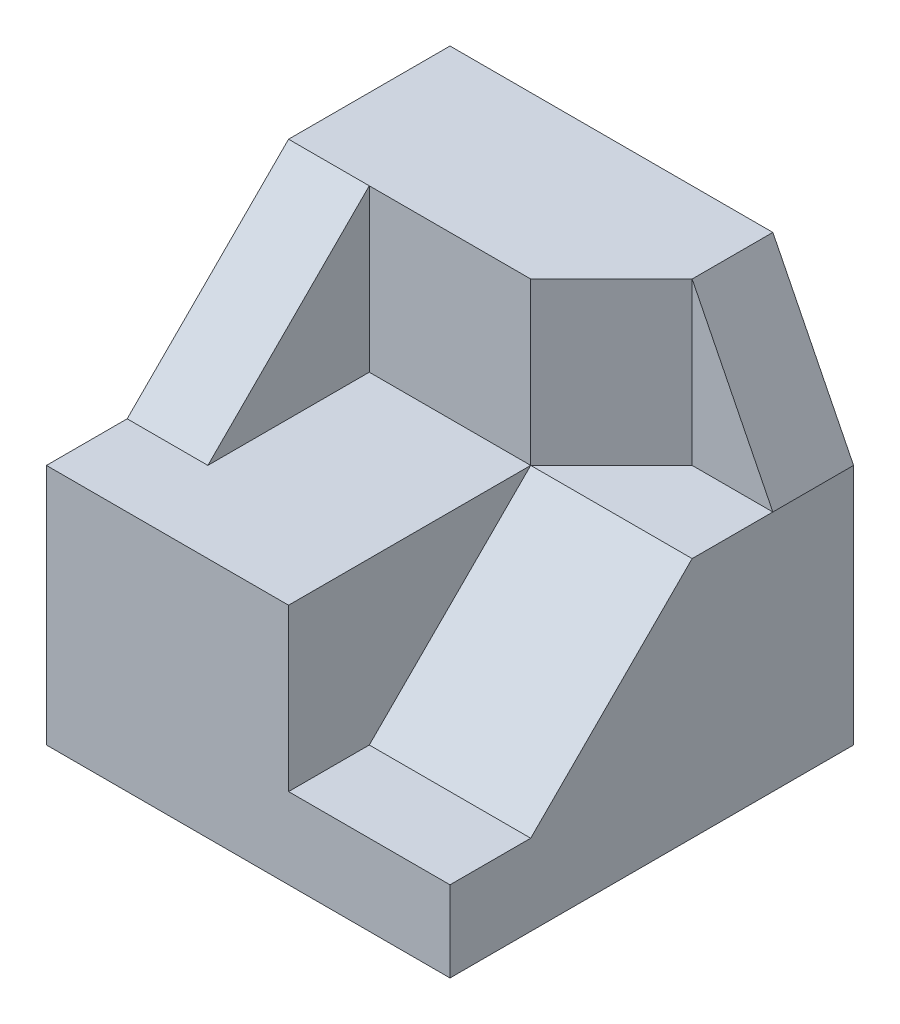
ISO-10303-21;
HEADER;
FILE_DESCRIPTION(('STEP AP214'),'2;1');
FILE_NAME('part.step','',(''),(''),'','','');
FILE_SCHEMA(('AUTOMOTIVE_DESIGN { 1 0 10303 214 1 1 1 1 }'));
ENDSEC;
DATA;
#1=APPLICATION_CONTEXT('core data for automotive mechanical design processes');
#2=APPLICATION_PROTOCOL_DEFINITION('international standard','automotive_design',2000,#1);
#3=PRODUCT_CONTEXT('',#1,'mechanical');
#4=PRODUCT('Part','Part','',(#3));
#5=PRODUCT_RELATED_PRODUCT_CATEGORY('part','',(#4));
#6=PRODUCT_DEFINITION_FORMATION('','',#4);
#7=PRODUCT_DEFINITION_CONTEXT('part definition',#1,'design');
#8=PRODUCT_DEFINITION('design','',#6,#7);
#9=PRODUCT_DEFINITION_SHAPE('','',#8);
#10=(LENGTH_UNIT() NAMED_UNIT(*) SI_UNIT(.MILLI.,.METRE.));
#11=(NAMED_UNIT(*) PLANE_ANGLE_UNIT() SI_UNIT($,.RADIAN.));
#12=(NAMED_UNIT(*) SI_UNIT($,.STERADIAN.) SOLID_ANGLE_UNIT());
#13=UNCERTAINTY_MEASURE_WITH_UNIT(LENGTH_MEASURE(1.E-05),#10,'distance_accuracy_value','');
#14=(GEOMETRIC_REPRESENTATION_CONTEXT(3) GLOBAL_UNCERTAINTY_ASSIGNED_CONTEXT((#13)) GLOBAL_UNIT_ASSIGNED_CONTEXT((#10,
#11,#12)) REPRESENTATION_CONTEXT('',''));
#15=CARTESIAN_POINT('',(0.,0.,0.));
#16=DIRECTION('',(0.,0.,1.));
#17=DIRECTION('',(1.,0.,0.));
#18=AXIS2_PLACEMENT_3D('',#15,#16,#17);
#19=CARTESIAN_POINT('',(-2.5,-2.5,5.));
#20=DIRECTION('',(1.,0.,0.));
#21=DIRECTION('',(0.,0.,-1.));
#22=AXIS2_PLACEMENT_3D('',#19,#20,#21);
#23=PLANE('',#22);
#24=DIRECTION('',(0.,0.,1.));
#25=VECTOR('',#24,1.);
#26=CARTESIAN_POINT('',(-2.5,0.5,4.));
#27=LINE('',#26,#25);
#28=CARTESIAN_POINT('',(-2.5,0.5,4.));
#29=VERTEX_POINT('',#28);
#30=CARTESIAN_POINT('',(-2.5,0.5,5.));
#31=VERTEX_POINT('',#30);
#32=EDGE_CURVE('E47',#29,#31,#27,.T.);
#33=ORIENTED_EDGE('',*,*,#32,.F.);
#34=DIRECTION('',(0.,-0.707106781186548,0.707106781186548));
#35=VECTOR('',#34,1.);
#36=CARTESIAN_POINT('',(-2.5,0.5,4.));
#37=LINE('',#36,#35);
#38=CARTESIAN_POINT('',(-2.5,2.5,2.));
#39=VERTEX_POINT('',#38);
#40=EDGE_CURVE('E96',#39,#29,#37,.T.);
#41=ORIENTED_EDGE('',*,*,#40,.F.);
#42=DIRECTION('',(0.,0.,-1.));
#43=VECTOR('',#42,1.);
#44=CARTESIAN_POINT('',(-2.5,2.5,5.));
#45=LINE('',#44,#43);
#46=CARTESIAN_POINT('',(-2.5,2.5,0.));
#47=VERTEX_POINT('',#46);
#48=EDGE_CURVE('E79',#39,#47,#45,.T.);
#49=ORIENTED_EDGE('',*,*,#48,.T.);
#50=DIRECTION('',(0.,-1.,0.));
#51=VECTOR('',#50,1.);
#52=CARTESIAN_POINT('',(-2.5,-2.5,0.));
#53=LINE('',#52,#51);
#54=CARTESIAN_POINT('',(-2.5,-2.5,0.));
#55=VERTEX_POINT('',#54);
#56=EDGE_CURVE('E94',#47,#55,#53,.T.);
#57=ORIENTED_EDGE('',*,*,#56,.T.);
#58=DIRECTION('',(0.,0.,-1.));
#59=VECTOR('',#58,1.);
#60=CARTESIAN_POINT('',(-2.5,-2.5,5.));
#61=LINE('',#60,#59);
#62=CARTESIAN_POINT('',(-2.5,-2.5,5.));
#63=VERTEX_POINT('',#62);
#64=EDGE_CURVE('E40',#63,#55,#61,.T.);
#65=ORIENTED_EDGE('',*,*,#64,.F.);
#66=DIRECTION('',(0.,-1.,0.));
#67=VECTOR('',#66,1.);
#68=CARTESIAN_POINT('',(-2.5,-2.5,5.));
#69=LINE('',#68,#67);
#70=EDGE_CURVE('E87',#31,#63,#69,.T.);
#71=ORIENTED_EDGE('',*,*,#70,.F.);
#72=EDGE_LOOP('',(#33,#41,#49,#57,#65,#71));
#73=FACE_BOUND('',#72,.T.);
#74=ADVANCED_FACE('F33',(#73),#23,.F.);
#75=CARTESIAN_POINT('',(2.5,-2.5,5.));
#76=DIRECTION('',(0.,1.,0.));
#77=DIRECTION('',(-1.,0.,0.));
#78=AXIS2_PLACEMENT_3D('',#75,#76,#77);
#79=PLANE('',#78);
#80=DIRECTION('',(1.,0.,0.));
#81=VECTOR('',#80,1.);
#82=CARTESIAN_POINT('',(2.5,-2.5,0.));
#83=LINE('',#82,#81);
#84=CARTESIAN_POINT('',(2.5,-2.5,0.));
#85=VERTEX_POINT('',#84);
#86=EDGE_CURVE('E102',#55,#85,#83,.T.);
#87=ORIENTED_EDGE('',*,*,#86,.T.);
#88=DIRECTION('',(0.,0.,-1.));
#89=VECTOR('',#88,1.);
#90=CARTESIAN_POINT('',(2.5,-2.5,5.));
#91=LINE('',#90,#89);
#92=CARTESIAN_POINT('',(2.5,-2.5,5.));
#93=VERTEX_POINT('',#92);
#94=EDGE_CURVE('E97',#93,#85,#91,.T.);
#95=ORIENTED_EDGE('',*,*,#94,.F.);
#96=DIRECTION('',(1.,0.,0.));
#97=VECTOR('',#96,1.);
#98=CARTESIAN_POINT('',(2.5,-2.5,5.));
#99=LINE('',#98,#97);
#100=EDGE_CURVE('E56',#63,#93,#99,.T.);
#101=ORIENTED_EDGE('',*,*,#100,.F.);
#102=ORIENTED_EDGE('',*,*,#64,.T.);
#103=EDGE_LOOP('',(#87,#95,#101,#102));
#104=FACE_BOUND('',#103,.T.);
#105=ADVANCED_FACE('F117',(#104),#79,.F.);
#106=CARTESIAN_POINT('',(2.5,-2.5,5.));
#107=DIRECTION('',(-1.,0.,0.));
#108=DIRECTION('',(0.,0.,1.));
#109=AXIS2_PLACEMENT_3D('',#106,#107,#108);
#110=PLANE('',#109);
#111=DIRECTION('',(0.,1.,0.));
#112=VECTOR('',#111,1.);
#113=CARTESIAN_POINT('',(2.5,-2.5,0.));
#114=LINE('',#113,#112);
#115=CARTESIAN_POINT('',(2.5,0.5,0.));
#116=VERTEX_POINT('',#115);
#117=EDGE_CURVE('E88',#85,#116,#114,.T.);
#118=ORIENTED_EDGE('',*,*,#117,.T.);
#119=DIRECTION('',(0.,0.,1.));
#120=VECTOR('',#119,1.);
#121=CARTESIAN_POINT('',(2.5,0.5,0.));
#122=LINE('',#121,#120);
#123=CARTESIAN_POINT('',(2.5,0.5,1.));
#124=VERTEX_POINT('',#123);
#125=EDGE_CURVE('E166',#116,#124,#122,.T.);
#126=ORIENTED_EDGE('',*,*,#125,.T.);
#127=DIRECTION('',(0.,0.,-1.));
#128=VECTOR('',#127,1.);
#129=CARTESIAN_POINT('',(2.5,0.5,2.));
#130=LINE('',#129,#128);
#131=CARTESIAN_POINT('',(2.5,0.5,2.));
#132=VERTEX_POINT('',#131);
#133=EDGE_CURVE('E184',#132,#124,#130,.T.);
#134=ORIENTED_EDGE('',*,*,#133,.F.);
#135=DIRECTION('',(0.,0.707106781186547,-0.707106781186548));
#136=VECTOR('',#135,1.);
#137=CARTESIAN_POINT('',(2.5,0.5,2.));
#138=LINE('',#137,#136);
#139=CARTESIAN_POINT('',(2.5,-1.5,4.));
#140=VERTEX_POINT('',#139);
#141=EDGE_CURVE('E163',#140,#132,#138,.T.);
#142=ORIENTED_EDGE('',*,*,#141,.F.);
#143=DIRECTION('',(0.,0.,1.));
#144=VECTOR('',#143,1.);
#145=CARTESIAN_POINT('',(2.5,-1.5,4.));
#146=LINE('',#145,#144);
#147=CARTESIAN_POINT('',(2.5,-1.5,5.));
#148=VERTEX_POINT('',#147);
#149=EDGE_CURVE('E142',#140,#148,#146,.T.);
#150=ORIENTED_EDGE('',*,*,#149,.T.);
#151=DIRECTION('',(0.,1.,0.));
#152=VECTOR('',#151,1.);
#153=CARTESIAN_POINT('',(2.5,-2.5,5.));
#154=LINE('',#153,#152);
#155=EDGE_CURVE('E98',#93,#148,#154,.T.);
#156=ORIENTED_EDGE('',*,*,#155,.F.);
#157=ORIENTED_EDGE('',*,*,#94,.T.);
#158=EDGE_LOOP('',(#118,#126,#134,#142,#150,#156,#157));
#159=FACE_BOUND('',#158,.T.);
#160=ADVANCED_FACE('F213',(#159),#110,.F.);
#161=CARTESIAN_POINT('',(2.5,2.5,5.));
#162=DIRECTION('',(0.,-1.,0.));
#163=DIRECTION('',(1.,0.,0.));
#164=AXIS2_PLACEMENT_3D('',#161,#162,#163);
#165=PLANE('',#164);
#166=DIRECTION('',(-1.,0.,0.));
#167=VECTOR('',#166,1.);
#168=CARTESIAN_POINT('',(0.5,2.5,2.));
#169=LINE('',#168,#167);
#170=CARTESIAN_POINT('',(0.5,2.5,2.));
#171=VERTEX_POINT('',#170);
#172=CARTESIAN_POINT('',(-1.5,2.5,2.));
#173=VERTEX_POINT('',#172);
#174=EDGE_CURVE('E121',#171,#173,#169,.T.);
#175=ORIENTED_EDGE('',*,*,#174,.F.);
#176=DIRECTION('',(-0.707106781186548,0.,0.707106781186547));
#177=VECTOR('',#176,1.);
#178=CARTESIAN_POINT('',(1.5,2.5,1.));
#179=LINE('',#178,#177);
#180=CARTESIAN_POINT('',(1.5,2.5,1.));
#181=VERTEX_POINT('',#180);
#182=EDGE_CURVE('E181',#181,#171,#179,.T.);
#183=ORIENTED_EDGE('',*,*,#182,.F.);
#184=DIRECTION('',(0.,0.,1.));
#185=VECTOR('',#184,1.);
#186=CARTESIAN_POINT('',(1.5,2.5,0.));
#187=LINE('',#186,#185);
#188=CARTESIAN_POINT('',(1.5,2.5,0.));
#189=VERTEX_POINT('',#188);
#190=EDGE_CURVE('E83',#189,#181,#187,.T.);
#191=ORIENTED_EDGE('',*,*,#190,.F.);
#192=DIRECTION('',(-1.,0.,0.));
#193=VECTOR('',#192,1.);
#194=CARTESIAN_POINT('',(2.5,2.5,0.));
#195=LINE('',#194,#193);
#196=EDGE_CURVE('E73',#189,#47,#195,.T.);
#197=ORIENTED_EDGE('',*,*,#196,.T.);
#198=ORIENTED_EDGE('',*,*,#48,.F.);
#199=DIRECTION('',(-1.,0.,0.));
#200=VECTOR('',#199,1.);
#201=CARTESIAN_POINT('',(-1.5,2.5,2.));
#202=LINE('',#201,#200);
#203=EDGE_CURVE('E124',#173,#39,#202,.T.);
#204=ORIENTED_EDGE('',*,*,#203,.F.);
#205=EDGE_LOOP('',(#175,#183,#191,#197,#198,#204));
#206=FACE_BOUND('',#205,.T.);
#207=ADVANCED_FACE('F76',(#206),#165,.F.);
#208=CARTESIAN_POINT('',(0.,0.,5.));
#209=DIRECTION('',(0.,0.,1.));
#210=DIRECTION('',(1.,0.,0.));
#211=AXIS2_PLACEMENT_3D('',#208,#209,#210);
#212=PLANE('',#211);
#213=DIRECTION('',(0.,-1.,0.));
#214=VECTOR('',#213,1.);
#215=CARTESIAN_POINT('',(0.5,-1.5,5.));
#216=LINE('',#215,#214);
#217=CARTESIAN_POINT('',(0.5,0.5,5.));
#218=VERTEX_POINT('',#217);
#219=CARTESIAN_POINT('',(0.5,-1.5,5.));
#220=VERTEX_POINT('',#219);
#221=EDGE_CURVE('E154',#218,#220,#216,.T.);
#222=ORIENTED_EDGE('',*,*,#221,.F.);
#223=DIRECTION('',(1.,0.,0.));
#224=VECTOR('',#223,1.);
#225=CARTESIAN_POINT('',(-2.5,0.5,5.));
#226=LINE('',#225,#224);
#227=EDGE_CURVE('E135',#31,#218,#226,.T.);
#228=ORIENTED_EDGE('',*,*,#227,.F.);
#229=ORIENTED_EDGE('',*,*,#70,.T.);
#230=ORIENTED_EDGE('',*,*,#100,.T.);
#231=ORIENTED_EDGE('',*,*,#155,.T.);
#232=DIRECTION('',(1.,0.,0.));
#233=VECTOR('',#232,1.);
#234=CARTESIAN_POINT('',(2.5,-1.5,5.));
#235=LINE('',#234,#233);
#236=EDGE_CURVE('E151',#220,#148,#235,.T.);
#237=ORIENTED_EDGE('',*,*,#236,.F.);
#238=EDGE_LOOP('',(#222,#228,#229,#230,#231,#237));
#239=FACE_BOUND('',#238,.T.);
#240=ADVANCED_FACE('F267',(#239),#212,.T.);
#241=CARTESIAN_POINT('',(0.,0.,0.));
#242=DIRECTION('',(0.,0.,1.));
#243=DIRECTION('',(1.,0.,0.));
#244=AXIS2_PLACEMENT_3D('',#241,#242,#243);
#245=PLANE('',#244);
#246=ORIENTED_EDGE('',*,*,#196,.F.);
#247=DIRECTION('',(0.447213595499958,-0.894427190999916,0.));
#248=VECTOR('',#247,1.);
#249=CARTESIAN_POINT('',(1.5,2.5,0.));
#250=LINE('',#249,#248);
#251=EDGE_CURVE('E170',#189,#116,#250,.T.);
#252=ORIENTED_EDGE('',*,*,#251,.T.);
#253=ORIENTED_EDGE('',*,*,#117,.F.);
#254=ORIENTED_EDGE('',*,*,#86,.F.);
#255=ORIENTED_EDGE('',*,*,#56,.F.);
#256=EDGE_LOOP('',(#246,#252,#253,#254,#255));
#257=FACE_BOUND('',#256,.T.);
#258=ADVANCED_FACE('F100',(#257),#245,.F.);
#259=CARTESIAN_POINT('',(-1.5,0.5,2.));
#260=DIRECTION('',(-1.,0.,0.));
#261=DIRECTION('',(0.,0.,1.));
#262=AXIS2_PLACEMENT_3D('',#259,#260,#261);
#263=PLANE('',#262);
#264=DIRECTION('',(0.,1.,0.));
#265=VECTOR('',#264,1.);
#266=CARTESIAN_POINT('',(-1.5,0.5,2.));
#267=LINE('',#266,#265);
#268=CARTESIAN_POINT('',(-1.5,0.5,2.));
#269=VERTEX_POINT('',#268);
#270=EDGE_CURVE('E104',#269,#173,#267,.T.);
#271=ORIENTED_EDGE('',*,*,#270,.T.);
#272=DIRECTION('',(0.,-0.707106781186548,0.707106781186548));
#273=VECTOR('',#272,1.);
#274=CARTESIAN_POINT('',(-1.5,0.5,4.));
#275=LINE('',#274,#273);
#276=CARTESIAN_POINT('',(-1.5,0.5,4.));
#277=VERTEX_POINT('',#276);
#278=EDGE_CURVE('E140',#173,#277,#275,.T.);
#279=ORIENTED_EDGE('',*,*,#278,.T.);
#280=DIRECTION('',(0.,0.,1.));
#281=VECTOR('',#280,1.);
#282=CARTESIAN_POINT('',(-1.5,0.5,2.));
#283=LINE('',#282,#281);
#284=EDGE_CURVE('E126',#269,#277,#283,.T.);
#285=ORIENTED_EDGE('',*,*,#284,.F.);
#286=EDGE_LOOP('',(#271,#279,#285));
#287=FACE_BOUND('',#286,.T.);
#288=ADVANCED_FACE('F249',(#287),#263,.F.);
#289=CARTESIAN_POINT('',(0.5,0.5,2.));
#290=DIRECTION('',(0.,0.,-1.));
#291=DIRECTION('',(-1.,0.,0.));
#292=AXIS2_PLACEMENT_3D('',#289,#290,#291);
#293=PLANE('',#292);
#294=DIRECTION('',(-1.,0.,0.));
#295=VECTOR('',#294,1.);
#296=CARTESIAN_POINT('',(0.5,0.5,2.));
#297=LINE('',#296,#295);
#298=CARTESIAN_POINT('',(0.5,0.5,2.));
#299=VERTEX_POINT('',#298);
#300=EDGE_CURVE('E129',#299,#269,#297,.T.);
#301=ORIENTED_EDGE('',*,*,#300,.F.);
#302=DIRECTION('',(0.,1.,0.));
#303=VECTOR('',#302,1.);
#304=CARTESIAN_POINT('',(0.5,0.5,2.));
#305=LINE('',#304,#303);
#306=EDGE_CURVE('E174',#299,#171,#305,.T.);
#307=ORIENTED_EDGE('',*,*,#306,.T.);
#308=ORIENTED_EDGE('',*,*,#174,.T.);
#309=ORIENTED_EDGE('',*,*,#270,.F.);
#310=EDGE_LOOP('',(#301,#307,#308,#309));
#311=FACE_BOUND('',#310,.T.);
#312=ADVANCED_FACE('F251',(#311),#293,.F.);
#313=CARTESIAN_POINT('',(0.,0.5,0.));
#314=DIRECTION('',(0.,1.,0.));
#315=DIRECTION('',(0.,0.,1.));
#316=AXIS2_PLACEMENT_3D('',#313,#314,#315);
#317=PLANE('',#316);
#318=ORIENTED_EDGE('',*,*,#32,.T.);
#319=ORIENTED_EDGE('',*,*,#227,.T.);
#320=DIRECTION('',(0.,0.,-1.));
#321=VECTOR('',#320,1.);
#322=CARTESIAN_POINT('',(0.5,0.5,5.));
#323=LINE('',#322,#321);
#324=EDGE_CURVE('E132',#218,#299,#323,.T.);
#325=ORIENTED_EDGE('',*,*,#324,.T.);
#326=ORIENTED_EDGE('',*,*,#300,.T.);
#327=ORIENTED_EDGE('',*,*,#284,.T.);
#328=DIRECTION('',(-1.,0.,0.));
#329=VECTOR('',#328,1.);
#330=CARTESIAN_POINT('',(-1.5,0.5,4.));
#331=LINE('',#330,#329);
#332=EDGE_CURVE('E108',#277,#29,#331,.T.);
#333=ORIENTED_EDGE('',*,*,#332,.T.);
#334=EDGE_LOOP('',(#318,#319,#325,#326,#327,#333));
#335=FACE_BOUND('',#334,.T.);
#336=ADVANCED_FACE('F245',(#335),#317,.T.);
#337=CARTESIAN_POINT('',(-1.5,0.5,4.));
#338=DIRECTION('',(0.,-0.707106781186547,-0.707106781186547));
#339=DIRECTION('',(0.,0.707106781186548,-0.707106781186548));
#340=AXIS2_PLACEMENT_3D('',#337,#338,#339);
#341=PLANE('',#340);
#342=ORIENTED_EDGE('',*,*,#40,.T.);
#343=ORIENTED_EDGE('',*,*,#332,.F.);
#344=ORIENTED_EDGE('',*,*,#278,.F.);
#345=ORIENTED_EDGE('',*,*,#203,.T.);
#346=EDGE_LOOP('',(#342,#343,#344,#345));
#347=FACE_BOUND('',#346,.T.);
#348=ADVANCED_FACE('F243',(#347),#341,.F.);
#349=CARTESIAN_POINT('',(0.5,-1.5,4.));
#350=DIRECTION('',(-1.,0.,0.));
#351=DIRECTION('',(0.,-1.,0.));
#352=AXIS2_PLACEMENT_3D('',#349,#350,#351);
#353=PLANE('',#352);
#354=ORIENTED_EDGE('',*,*,#324,.F.);
#355=ORIENTED_EDGE('',*,*,#221,.T.);
#356=DIRECTION('',(0.,0.,1.));
#357=VECTOR('',#356,1.);
#358=CARTESIAN_POINT('',(0.5,-1.5,4.));
#359=LINE('',#358,#357);
#360=CARTESIAN_POINT('',(0.5,-1.5,4.));
#361=VERTEX_POINT('',#360);
#362=EDGE_CURVE('E145',#361,#220,#359,.T.);
#363=ORIENTED_EDGE('',*,*,#362,.F.);
#364=DIRECTION('',(0.,0.707106781186547,-0.707106781186548));
#365=VECTOR('',#364,1.);
#366=CARTESIAN_POINT('',(0.5,0.5,2.));
#367=LINE('',#366,#365);
#368=EDGE_CURVE('E162',#361,#299,#367,.T.);
#369=ORIENTED_EDGE('',*,*,#368,.T.);
#370=EDGE_LOOP('',(#354,#355,#363,#369));
#371=FACE_BOUND('',#370,.T.);
#372=ADVANCED_FACE('F261',(#371),#353,.F.);
#373=CARTESIAN_POINT('',(2.5,-1.5,4.));
#374=DIRECTION('',(0.,-1.,0.));
#375=DIRECTION('',(1.,0.,0.));
#376=AXIS2_PLACEMENT_3D('',#373,#374,#375);
#377=PLANE('',#376);
#378=ORIENTED_EDGE('',*,*,#236,.T.);
#379=ORIENTED_EDGE('',*,*,#149,.F.);
#380=DIRECTION('',(1.,0.,0.));
#381=VECTOR('',#380,1.);
#382=CARTESIAN_POINT('',(2.5,-1.5,4.));
#383=LINE('',#382,#381);
#384=EDGE_CURVE('E148',#361,#140,#383,.T.);
#385=ORIENTED_EDGE('',*,*,#384,.F.);
#386=ORIENTED_EDGE('',*,*,#362,.T.);
#387=EDGE_LOOP('',(#378,#379,#385,#386));
#388=FACE_BOUND('',#387,.T.);
#389=ADVANCED_FACE('F266',(#388),#377,.F.);
#390=CARTESIAN_POINT('',(0.5,0.5,2.));
#391=DIRECTION('',(0.,-0.707106781186548,-0.707106781186547));
#392=DIRECTION('',(0.,0.707106781186547,-0.707106781186548));
#393=AXIS2_PLACEMENT_3D('',#390,#391,#392);
#394=PLANE('',#393);
#395=ORIENTED_EDGE('',*,*,#141,.T.);
#396=DIRECTION('',(1.,0.,0.));
#397=VECTOR('',#396,1.);
#398=CARTESIAN_POINT('',(0.5,0.5,2.));
#399=LINE('',#398,#397);
#400=EDGE_CURVE('E157',#299,#132,#399,.T.);
#401=ORIENTED_EDGE('',*,*,#400,.F.);
#402=ORIENTED_EDGE('',*,*,#368,.F.);
#403=ORIENTED_EDGE('',*,*,#384,.T.);
#404=EDGE_LOOP('',(#395,#401,#402,#403));
#405=FACE_BOUND('',#404,.T.);
#406=ADVANCED_FACE('F259',(#405),#394,.F.);
#407=CARTESIAN_POINT('',(1.5,2.5,0.));
#408=DIRECTION('',(-0.894427190999916,-0.447213595499958,0.));
#409=DIRECTION('',(0.447213595499958,-0.894427190999916,0.));
#410=AXIS2_PLACEMENT_3D('',#407,#408,#409);
#411=PLANE('',#410);
#412=ORIENTED_EDGE('',*,*,#190,.T.);
#413=DIRECTION('',(0.447213595499958,-0.894427190999916,0.));
#414=VECTOR('',#413,1.);
#415=CARTESIAN_POINT('',(1.5,2.5,1.));
#416=LINE('',#415,#414);
#417=EDGE_CURVE('E11',#181,#124,#416,.T.);
#418=ORIENTED_EDGE('',*,*,#417,.T.);
#419=ORIENTED_EDGE('',*,*,#125,.F.);
#420=ORIENTED_EDGE('',*,*,#251,.F.);
#421=EDGE_LOOP('',(#412,#418,#419,#420));
#422=FACE_BOUND('',#421,.T.);
#423=ADVANCED_FACE('F207',(#422),#411,.F.);
#424=CARTESIAN_POINT('',(2.5,0.5,1.));
#425=DIRECTION('',(0.,0.,-1.));
#426=DIRECTION('',(-1.,0.,0.));
#427=AXIS2_PLACEMENT_3D('',#424,#425,#426);
#428=PLANE('',#427);
#429=DIRECTION('',(0.,1.,0.));
#430=VECTOR('',#429,1.);
#431=CARTESIAN_POINT('',(1.5,0.5,1.));
#432=LINE('',#431,#430);
#433=CARTESIAN_POINT('',(1.5,0.5,1.));
#434=VERTEX_POINT('',#433);
#435=EDGE_CURVE('E175',#434,#181,#432,.T.);
#436=ORIENTED_EDGE('',*,*,#435,.F.);
#437=DIRECTION('',(-1.,0.,0.));
#438=VECTOR('',#437,1.);
#439=CARTESIAN_POINT('',(2.5,0.5,1.));
#440=LINE('',#439,#438);
#441=EDGE_CURVE('E187',#124,#434,#440,.T.);
#442=ORIENTED_EDGE('',*,*,#441,.F.);
#443=ORIENTED_EDGE('',*,*,#417,.F.);
#444=EDGE_LOOP('',(#436,#442,#443));
#445=FACE_BOUND('',#444,.T.);
#446=ADVANCED_FACE('F340',(#445),#428,.F.);
#447=CARTESIAN_POINT('',(1.5,0.5,1.));
#448=DIRECTION('',(-0.707106781186547,0.,-0.707106781186548));
#449=DIRECTION('',(-0.707106781186548,0.,0.707106781186547));
#450=AXIS2_PLACEMENT_3D('',#447,#448,#449);
#451=PLANE('',#450);
#452=ORIENTED_EDGE('',*,*,#182,.T.);
#453=ORIENTED_EDGE('',*,*,#306,.F.);
#454=DIRECTION('',(-0.707106781186548,0.,0.707106781186547));
#455=VECTOR('',#454,1.);
#456=CARTESIAN_POINT('',(1.5,0.5,1.));
#457=LINE('',#456,#455);
#458=EDGE_CURVE('E178',#434,#299,#457,.T.);
#459=ORIENTED_EDGE('',*,*,#458,.F.);
#460=ORIENTED_EDGE('',*,*,#435,.T.);
#461=EDGE_LOOP('',(#452,#453,#459,#460));
#462=FACE_BOUND('',#461,.T.);
#463=ADVANCED_FACE('F254',(#462),#451,.F.);
#464=CARTESIAN_POINT('',(0.,0.5,0.));
#465=DIRECTION('',(0.,1.,0.));
#466=DIRECTION('',(0.,0.,1.));
#467=AXIS2_PLACEMENT_3D('',#464,#465,#466);
#468=PLANE('',#467);
#469=ORIENTED_EDGE('',*,*,#400,.T.);
#470=ORIENTED_EDGE('',*,*,#133,.T.);
#471=ORIENTED_EDGE('',*,*,#441,.T.);
#472=ORIENTED_EDGE('',*,*,#458,.T.);
#473=EDGE_LOOP('',(#469,#470,#471,#472));
#474=FACE_BOUND('',#473,.T.);
#475=ADVANCED_FACE('F194',(#474),#468,.T.);
#476=CLOSED_SHELL('',(#74,#105,#160,#207,#240,#258,#288,#312,#336,#348,#372,#389,#406,#423,#446,
#463,#475));
#477=MANIFOLD_SOLID_BREP('B2',#476);
#478=ADVANCED_BREP_SHAPE_REPRESENTATION('',(#18,#477),#14);
#479=SHAPE_DEFINITION_REPRESENTATION(#9,#478);
ENDSEC;
END-ISO-10303-21;
